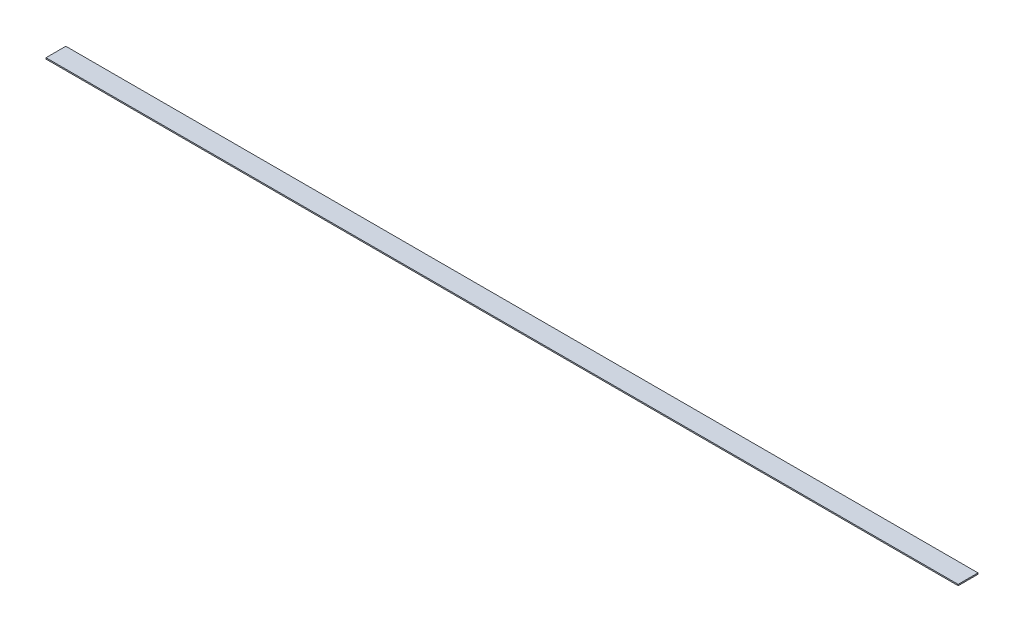
ISO-10303-21;
HEADER;
FILE_DESCRIPTION(('STEP AP214'),'2;1');
FILE_NAME('part.step','',(''),(''),'','','');
FILE_SCHEMA(('AUTOMOTIVE_DESIGN { 1 0 10303 214 1 1 1 1 }'));
ENDSEC;
DATA;
#1=APPLICATION_CONTEXT('core data for automotive mechanical design processes');
#2=APPLICATION_PROTOCOL_DEFINITION('international standard','automotive_design',2000,#1);
#3=PRODUCT_CONTEXT('',#1,'mechanical');
#4=PRODUCT('Part','Part','',(#3));
#5=PRODUCT_RELATED_PRODUCT_CATEGORY('part','',(#4));
#6=PRODUCT_DEFINITION_FORMATION('','',#4);
#7=PRODUCT_DEFINITION_CONTEXT('part definition',#1,'design');
#8=PRODUCT_DEFINITION('design','',#6,#7);
#9=PRODUCT_DEFINITION_SHAPE('','',#8);
#10=(LENGTH_UNIT() NAMED_UNIT(*) SI_UNIT(.MILLI.,.METRE.));
#11=(NAMED_UNIT(*) PLANE_ANGLE_UNIT() SI_UNIT($,.RADIAN.));
#12=(NAMED_UNIT(*) SI_UNIT($,.STERADIAN.) SOLID_ANGLE_UNIT());
#13=UNCERTAINTY_MEASURE_WITH_UNIT(LENGTH_MEASURE(1.E-05),#10,'distance_accuracy_value','');
#14=(GEOMETRIC_REPRESENTATION_CONTEXT(3) GLOBAL_UNCERTAINTY_ASSIGNED_CONTEXT((#13)) GLOBAL_UNIT_ASSIGNED_CONTEXT((#10,
#11,#12)) REPRESENTATION_CONTEXT('',''));
#15=CARTESIAN_POINT('',(0.,0.,0.));
#16=DIRECTION('',(0.,0.,1.));
#17=DIRECTION('',(1.,0.,0.));
#18=AXIS2_PLACEMENT_3D('',#15,#16,#17);
#19=CARTESIAN_POINT('',(0.,1.5875,0.));
#20=DIRECTION('',(1.,0.,0.));
#21=DIRECTION('',(0.,0.,-1.));
#22=AXIS2_PLACEMENT_3D('',#19,#20,#21);
#23=PLANE('',#22);
#24=DIRECTION('',(0.,0.,1.));
#25=VECTOR('',#24,1.);
#26=CARTESIAN_POINT('',(0.,0.,0.));
#27=LINE('',#26,#25);
#28=CARTESIAN_POINT('',(0.,0.,-25.4));
#29=VERTEX_POINT('',#28);
#30=CARTESIAN_POINT('',(0.,0.,0.));
#31=VERTEX_POINT('',#30);
#32=EDGE_CURVE('E96',#29,#31,#27,.T.);
#33=ORIENTED_EDGE('',*,*,#32,.T.);
#34=DIRECTION('',(0.,-1.,0.));
#35=VECTOR('',#34,1.);
#36=CARTESIAN_POINT('',(0.,1.5875,0.));
#37=LINE('',#36,#35);
#38=CARTESIAN_POINT('',(0.,1.5875,0.));
#39=VERTEX_POINT('',#38);
#40=EDGE_CURVE('E11',#39,#31,#37,.T.);
#41=ORIENTED_EDGE('',*,*,#40,.F.);
#42=DIRECTION('',(0.,0.,1.));
#43=VECTOR('',#42,1.);
#44=CARTESIAN_POINT('',(0.,1.5875,0.));
#45=LINE('',#44,#43);
#46=CARTESIAN_POINT('',(0.,1.5875,-25.4));
#47=VERTEX_POINT('',#46);
#48=EDGE_CURVE('E84',#47,#39,#45,.T.);
#49=ORIENTED_EDGE('',*,*,#48,.F.);
#50=DIRECTION('',(0.,-1.,0.));
#51=VECTOR('',#50,1.);
#52=CARTESIAN_POINT('',(0.,1.5875,-25.4));
#53=LINE('',#52,#51);
#54=EDGE_CURVE('E92',#47,#29,#53,.T.);
#55=ORIENTED_EDGE('',*,*,#54,.T.);
#56=EDGE_LOOP('',(#33,#41,#49,#55));
#57=FACE_BOUND('',#56,.T.);
#58=ADVANCED_FACE('F33',(#57),#23,.F.);
#59=CARTESIAN_POINT('',(0.,1.5875,0.));
#60=DIRECTION('',(0.,0.,-1.));
#61=DIRECTION('',(-1.,0.,0.));
#62=AXIS2_PLACEMENT_3D('',#59,#60,#61);
#63=PLANE('',#62);
#64=DIRECTION('',(1.,0.,0.));
#65=VECTOR('',#64,1.);
#66=CARTESIAN_POINT('',(0.,0.,0.));
#67=LINE('',#66,#65);
#68=CARTESIAN_POINT('',(1168.4,0.,0.));
#69=VERTEX_POINT('',#68);
#70=EDGE_CURVE('E88',#31,#69,#67,.T.);
#71=ORIENTED_EDGE('',*,*,#70,.T.);
#72=DIRECTION('',(0.,-1.,0.));
#73=VECTOR('',#72,1.);
#74=CARTESIAN_POINT('',(1168.4,1.5875,0.));
#75=LINE('',#74,#73);
#76=CARTESIAN_POINT('',(1168.4,1.5875,0.));
#77=VERTEX_POINT('',#76);
#78=EDGE_CURVE('E41',#77,#69,#75,.T.);
#79=ORIENTED_EDGE('',*,*,#78,.F.);
#80=DIRECTION('',(1.,0.,0.));
#81=VECTOR('',#80,1.);
#82=CARTESIAN_POINT('',(0.,1.5875,0.));
#83=LINE('',#82,#81);
#84=EDGE_CURVE('E79',#39,#77,#83,.T.);
#85=ORIENTED_EDGE('',*,*,#84,.F.);
#86=ORIENTED_EDGE('',*,*,#40,.T.);
#87=EDGE_LOOP('',(#71,#79,#85,#86));
#88=FACE_BOUND('',#87,.T.);
#89=ADVANCED_FACE('F87',(#88),#63,.F.);
#90=CARTESIAN_POINT('',(1168.4,1.5875,0.));
#91=DIRECTION('',(-1.,0.,0.));
#92=DIRECTION('',(0.,0.,1.));
#93=AXIS2_PLACEMENT_3D('',#90,#91,#92);
#94=PLANE('',#93);
#95=DIRECTION('',(0.,0.,-1.));
#96=VECTOR('',#95,1.);
#97=CARTESIAN_POINT('',(1168.4,0.,0.));
#98=LINE('',#97,#96);
#99=CARTESIAN_POINT('',(1168.4,0.,-25.4));
#100=VERTEX_POINT('',#99);
#101=EDGE_CURVE('E66',#69,#100,#98,.T.);
#102=ORIENTED_EDGE('',*,*,#101,.T.);
#103=DIRECTION('',(0.,-1.,0.));
#104=VECTOR('',#103,1.);
#105=CARTESIAN_POINT('',(1168.4,1.5875,-25.4));
#106=LINE('',#105,#104);
#107=CARTESIAN_POINT('',(1168.4,1.5875,-25.4));
#108=VERTEX_POINT('',#107);
#109=EDGE_CURVE('E89',#108,#100,#106,.T.);
#110=ORIENTED_EDGE('',*,*,#109,.F.);
#111=DIRECTION('',(0.,0.,-1.));
#112=VECTOR('',#111,1.);
#113=CARTESIAN_POINT('',(1168.4,1.5875,0.));
#114=LINE('',#113,#112);
#115=EDGE_CURVE('E82',#77,#108,#114,.T.);
#116=ORIENTED_EDGE('',*,*,#115,.F.);
#117=ORIENTED_EDGE('',*,*,#78,.T.);
#118=EDGE_LOOP('',(#102,#110,#116,#117));
#119=FACE_BOUND('',#118,.T.);
#120=ADVANCED_FACE('F90',(#119),#94,.F.);
#121=CARTESIAN_POINT('',(0.,1.5875,-25.4));
#122=DIRECTION('',(0.,0.,1.));
#123=DIRECTION('',(1.,0.,0.));
#124=AXIS2_PLACEMENT_3D('',#121,#122,#123);
#125=PLANE('',#124);
#126=DIRECTION('',(-1.,0.,0.));
#127=VECTOR('',#126,1.);
#128=CARTESIAN_POINT('',(0.,0.,-25.4));
#129=LINE('',#128,#127);
#130=EDGE_CURVE('E72',#100,#29,#129,.T.);
#131=ORIENTED_EDGE('',*,*,#130,.T.);
#132=ORIENTED_EDGE('',*,*,#54,.F.);
#133=DIRECTION('',(-1.,0.,0.));
#134=VECTOR('',#133,1.);
#135=CARTESIAN_POINT('',(0.,1.5875,-25.4));
#136=LINE('',#135,#134);
#137=EDGE_CURVE('E49',#108,#47,#136,.T.);
#138=ORIENTED_EDGE('',*,*,#137,.F.);
#139=ORIENTED_EDGE('',*,*,#109,.T.);
#140=EDGE_LOOP('',(#131,#132,#138,#139));
#141=FACE_BOUND('',#140,.T.);
#142=ADVANCED_FACE('F103',(#141),#125,.F.);
#143=CARTESIAN_POINT('',(0.,1.5875,0.));
#144=DIRECTION('',(0.,-1.,0.));
#145=DIRECTION('',(0.,0.,-1.));
#146=AXIS2_PLACEMENT_3D('',#143,#144,#145);
#147=PLANE('',#146);
#148=ORIENTED_EDGE('',*,*,#48,.T.);
#149=ORIENTED_EDGE('',*,*,#84,.T.);
#150=ORIENTED_EDGE('',*,*,#115,.T.);
#151=ORIENTED_EDGE('',*,*,#137,.T.);
#152=EDGE_LOOP('',(#148,#149,#150,#151));
#153=FACE_BOUND('',#152,.T.);
#154=ADVANCED_FACE('F80',(#153),#147,.F.);
#155=CARTESIAN_POINT('',(0.,0.,0.));
#156=DIRECTION('',(0.,-1.,0.));
#157=DIRECTION('',(0.,0.,-1.));
#158=AXIS2_PLACEMENT_3D('',#155,#156,#157);
#159=PLANE('',#158);
#160=ORIENTED_EDGE('',*,*,#32,.F.);
#161=ORIENTED_EDGE('',*,*,#130,.F.);
#162=ORIENTED_EDGE('',*,*,#101,.F.);
#163=ORIENTED_EDGE('',*,*,#70,.F.);
#164=EDGE_LOOP('',(#160,#161,#162,#163));
#165=FACE_BOUND('',#164,.T.);
#166=ADVANCED_FACE('F106',(#165),#159,.T.);
#167=CLOSED_SHELL('',(#58,#89,#120,#142,#154,#166));
#168=MANIFOLD_SOLID_BREP('B2',#167);
#169=ADVANCED_BREP_SHAPE_REPRESENTATION('',(#18,#168),#14);
#170=SHAPE_DEFINITION_REPRESENTATION(#9,#169);
ENDSEC;
END-ISO-10303-21;
